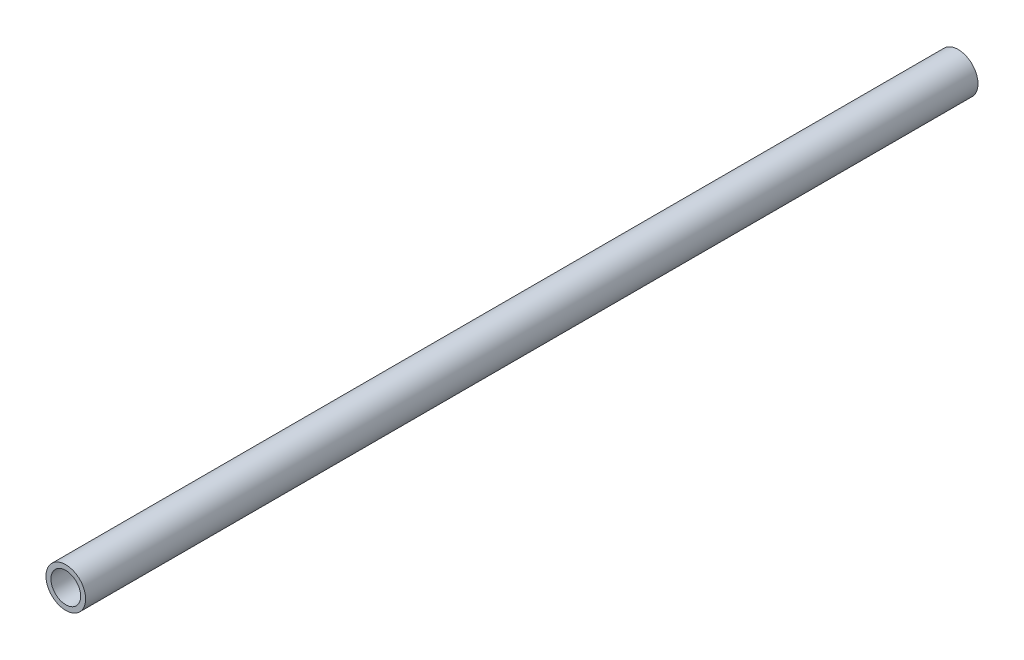
ISO-10303-21;
HEADER;
FILE_DESCRIPTION(('STEP AP214'),'2;1');
FILE_NAME('part.step','',(''),(''),'','','');
FILE_SCHEMA(('AUTOMOTIVE_DESIGN { 1 0 10303 214 1 1 1 1 }'));
ENDSEC;
DATA;
#1=APPLICATION_CONTEXT('core data for automotive mechanical design processes');
#2=APPLICATION_PROTOCOL_DEFINITION('international standard','automotive_design',2000,#1);
#3=PRODUCT_CONTEXT('',#1,'mechanical');
#4=PRODUCT('Part','Part','',(#3));
#5=PRODUCT_RELATED_PRODUCT_CATEGORY('part','',(#4));
#6=PRODUCT_DEFINITION_FORMATION('','',#4);
#7=PRODUCT_DEFINITION_CONTEXT('part definition',#1,'design');
#8=PRODUCT_DEFINITION('design','',#6,#7);
#9=PRODUCT_DEFINITION_SHAPE('','',#8);
#10=(LENGTH_UNIT() NAMED_UNIT(*) SI_UNIT(.MILLI.,.METRE.));
#11=(NAMED_UNIT(*) PLANE_ANGLE_UNIT() SI_UNIT($,.RADIAN.));
#12=(NAMED_UNIT(*) SI_UNIT($,.STERADIAN.) SOLID_ANGLE_UNIT());
#13=UNCERTAINTY_MEASURE_WITH_UNIT(LENGTH_MEASURE(1.E-05),#10,'distance_accuracy_value','');
#14=(GEOMETRIC_REPRESENTATION_CONTEXT(3) GLOBAL_UNCERTAINTY_ASSIGNED_CONTEXT((#13)) GLOBAL_UNIT_ASSIGNED_CONTEXT((#10,
#11,#12)) REPRESENTATION_CONTEXT('',''));
#15=CARTESIAN_POINT('',(0.,0.,0.));
#16=DIRECTION('',(0.,0.,1.));
#17=DIRECTION('',(1.,0.,0.));
#18=AXIS2_PLACEMENT_3D('',#15,#16,#17);
#19=CARTESIAN_POINT('',(0.,0.,180.));
#20=DIRECTION('',(0.,0.,1.));
#21=DIRECTION('',(1.,0.,0.));
#22=AXIS2_PLACEMENT_3D('',#19,#20,#21);
#23=PLANE('',#22);
#24=CARTESIAN_POINT('',(0.,0.,180.));
#25=DIRECTION('',(0.,0.,1.));
#26=DIRECTION('',(1.,0.,0.));
#27=AXIS2_PLACEMENT_3D('',#24,#25,#26);
#28=CIRCLE('',#27,4.);
#29=CARTESIAN_POINT('',(4.,0.,180.));
#30=VERTEX_POINT('',#29);
#31=EDGE_CURVE('E10',#30,#30,#28,.T.);
#32=ORIENTED_EDGE('',*,*,#31,.T.);
#33=EDGE_LOOP('',(#32));
#34=FACE_BOUND('',#33,.T.);
#35=CARTESIAN_POINT('',(0.,0.,180.));
#36=DIRECTION('',(0.,0.,1.));
#37=DIRECTION('',(1.,0.,0.));
#38=AXIS2_PLACEMENT_3D('',#35,#36,#37);
#39=CIRCLE('',#38,3.);
#40=CARTESIAN_POINT('',(3.,0.,180.));
#41=VERTEX_POINT('',#40);
#42=EDGE_CURVE('E44',#41,#41,#39,.T.);
#43=ORIENTED_EDGE('',*,*,#42,.F.);
#44=EDGE_LOOP('',(#43));
#45=FACE_BOUND('',#44,.T.);
#46=ADVANCED_FACE('F33',(#34,#45),#23,.T.);
#47=CARTESIAN_POINT('',(0.,0.,0.));
#48=DIRECTION('',(0.,0.,1.));
#49=DIRECTION('',(1.,0.,0.));
#50=AXIS2_PLACEMENT_3D('',#47,#48,#49);
#51=PLANE('',#50);
#52=CARTESIAN_POINT('',(0.,0.,0.));
#53=DIRECTION('',(0.,0.,1.));
#54=DIRECTION('',(1.,0.,0.));
#55=AXIS2_PLACEMENT_3D('',#52,#53,#54);
#56=CIRCLE('',#55,4.);
#57=CARTESIAN_POINT('',(4.,0.,0.));
#58=VERTEX_POINT('',#57);
#59=EDGE_CURVE('E37',#58,#58,#56,.T.);
#60=ORIENTED_EDGE('',*,*,#59,.F.);
#61=EDGE_LOOP('',(#60));
#62=FACE_BOUND('',#61,.T.);
#63=CARTESIAN_POINT('',(0.,0.,0.));
#64=DIRECTION('',(0.,0.,1.));
#65=DIRECTION('',(1.,0.,0.));
#66=AXIS2_PLACEMENT_3D('',#63,#64,#65);
#67=CIRCLE('',#66,3.);
#68=CARTESIAN_POINT('',(3.,0.,0.));
#69=VERTEX_POINT('',#68);
#70=EDGE_CURVE('E46',#69,#69,#67,.T.);
#71=ORIENTED_EDGE('',*,*,#70,.T.);
#72=EDGE_LOOP('',(#71));
#73=FACE_BOUND('',#72,.T.);
#74=ADVANCED_FACE('F56',(#62,#73),#51,.F.);
#75=CARTESIAN_POINT('',(0.,0.,180.));
#76=DIRECTION('',(0.,0.,-1.));
#77=DIRECTION('',(-1.,0.,0.));
#78=AXIS2_PLACEMENT_3D('',#75,#76,#77);
#79=CYLINDRICAL_SURFACE('',#78,4.);
#80=ORIENTED_EDGE('',*,*,#31,.F.);
#81=EDGE_LOOP('',(#80));
#82=FACE_BOUND('',#81,.T.);
#83=ORIENTED_EDGE('',*,*,#59,.T.);
#84=EDGE_LOOP('',(#83));
#85=FACE_BOUND('',#84,.T.);
#86=ADVANCED_FACE('F35',(#82,#85),#79,.T.);
#87=CARTESIAN_POINT('',(0.,0.,180.));
#88=DIRECTION('',(0.,0.,-1.));
#89=DIRECTION('',(-1.,0.,0.));
#90=AXIS2_PLACEMENT_3D('',#87,#88,#89);
#91=CYLINDRICAL_SURFACE('',#90,3.);
#92=ORIENTED_EDGE('',*,*,#42,.T.);
#93=EDGE_LOOP('',(#92));
#94=FACE_BOUND('',#93,.T.);
#95=ORIENTED_EDGE('',*,*,#70,.F.);
#96=EDGE_LOOP('',(#95));
#97=FACE_BOUND('',#96,.T.);
#98=ADVANCED_FACE('F52',(#94,#97),#91,.F.);
#99=CLOSED_SHELL('',(#46,#74,#86,#98));
#100=MANIFOLD_SOLID_BREP('B2',#99);
#101=ADVANCED_BREP_SHAPE_REPRESENTATION('',(#18,#100),#14);
#102=SHAPE_DEFINITION_REPRESENTATION(#9,#101);
ENDSEC;
END-ISO-10303-21;
